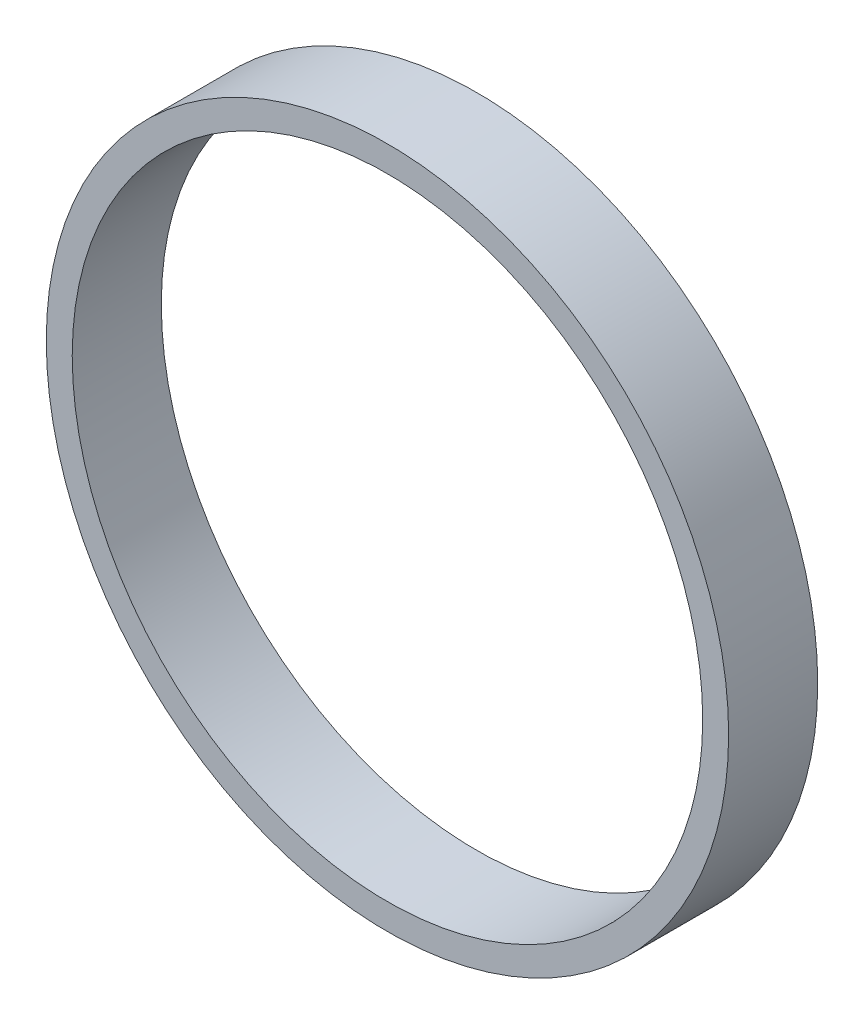
ISO-10303-21;
HEADER;
FILE_DESCRIPTION(('STEP AP214'),'2;1');
FILE_NAME('part.step','',(''),(''),'','','');
FILE_SCHEMA(('AUTOMOTIVE_DESIGN { 1 0 10303 214 1 1 1 1 }'));
ENDSEC;
DATA;
#1=APPLICATION_CONTEXT('core data for automotive mechanical design processes');
#2=APPLICATION_PROTOCOL_DEFINITION('international standard','automotive_design',2000,#1);
#3=PRODUCT_CONTEXT('',#1,'mechanical');
#4=PRODUCT('Part','Part','',(#3));
#5=PRODUCT_RELATED_PRODUCT_CATEGORY('part','',(#4));
#6=PRODUCT_DEFINITION_FORMATION('','',#4);
#7=PRODUCT_DEFINITION_CONTEXT('part definition',#1,'design');
#8=PRODUCT_DEFINITION('design','',#6,#7);
#9=PRODUCT_DEFINITION_SHAPE('','',#8);
#10=(LENGTH_UNIT() NAMED_UNIT(*) SI_UNIT(.MILLI.,.METRE.));
#11=(NAMED_UNIT(*) PLANE_ANGLE_UNIT() SI_UNIT($,.RADIAN.));
#12=(NAMED_UNIT(*) SI_UNIT($,.STERADIAN.) SOLID_ANGLE_UNIT());
#13=UNCERTAINTY_MEASURE_WITH_UNIT(LENGTH_MEASURE(1.E-05),#10,'distance_accuracy_value','');
#14=(GEOMETRIC_REPRESENTATION_CONTEXT(3) GLOBAL_UNCERTAINTY_ASSIGNED_CONTEXT((#13)) GLOBAL_UNIT_ASSIGNED_CONTEXT((#10,
#11,#12)) REPRESENTATION_CONTEXT('',''));
#15=CARTESIAN_POINT('',(0.,0.,0.));
#16=DIRECTION('',(0.,0.,1.));
#17=DIRECTION('',(1.,0.,0.));
#18=AXIS2_PLACEMENT_3D('',#15,#16,#17);
#19=CARTESIAN_POINT('',(0.,0.,10.3));
#20=DIRECTION('',(0.,0.,1.));
#21=DIRECTION('',(1.,0.,0.));
#22=AXIS2_PLACEMENT_3D('',#19,#20,#21);
#23=PLANE('',#22);
#24=CARTESIAN_POINT('',(0.,0.,10.3));
#25=DIRECTION('',(0.,0.,1.));
#26=DIRECTION('',(1.,0.,0.));
#27=AXIS2_PLACEMENT_3D('',#24,#25,#26);
#28=CIRCLE('',#27,78.9);
#29=CARTESIAN_POINT('',(78.9,0.,10.3));
#30=VERTEX_POINT('',#29);
#31=EDGE_CURVE('E10',#30,#30,#28,.T.);
#32=ORIENTED_EDGE('',*,*,#31,.T.);
#33=EDGE_LOOP('',(#32));
#34=FACE_BOUND('',#33,.T.);
#35=CARTESIAN_POINT('',(0.,0.,10.3));
#36=DIRECTION('',(0.,0.,1.));
#37=DIRECTION('',(1.,0.,0.));
#38=AXIS2_PLACEMENT_3D('',#35,#36,#37);
#39=CIRCLE('',#38,72.9);
#40=CARTESIAN_POINT('',(72.9,0.,10.3));
#41=VERTEX_POINT('',#40);
#42=EDGE_CURVE('E42',#41,#41,#39,.T.);
#43=ORIENTED_EDGE('',*,*,#42,.F.);
#44=EDGE_LOOP('',(#43));
#45=FACE_BOUND('',#44,.T.);
#46=ADVANCED_FACE('F31',(#34,#45),#23,.T.);
#47=CARTESIAN_POINT('',(0.,0.,-10.3));
#48=DIRECTION('',(0.,0.,1.));
#49=DIRECTION('',(1.,0.,0.));
#50=AXIS2_PLACEMENT_3D('',#47,#48,#49);
#51=PLANE('',#50);
#52=CARTESIAN_POINT('',(0.,0.,-10.3));
#53=DIRECTION('',(0.,0.,1.));
#54=DIRECTION('',(1.,0.,0.));
#55=AXIS2_PLACEMENT_3D('',#52,#53,#54);
#56=CIRCLE('',#55,78.9);
#57=CARTESIAN_POINT('',(78.9,0.,-10.3));
#58=VERTEX_POINT('',#57);
#59=EDGE_CURVE('E35',#58,#58,#56,.T.);
#60=ORIENTED_EDGE('',*,*,#59,.F.);
#61=EDGE_LOOP('',(#60));
#62=FACE_BOUND('',#61,.T.);
#63=CARTESIAN_POINT('',(0.,0.,-10.3));
#64=DIRECTION('',(0.,0.,1.));
#65=DIRECTION('',(1.,0.,0.));
#66=AXIS2_PLACEMENT_3D('',#63,#64,#65);
#67=CIRCLE('',#66,72.9);
#68=CARTESIAN_POINT('',(72.9,0.,-10.3));
#69=VERTEX_POINT('',#68);
#70=EDGE_CURVE('E44',#69,#69,#67,.T.);
#71=ORIENTED_EDGE('',*,*,#70,.T.);
#72=EDGE_LOOP('',(#71));
#73=FACE_BOUND('',#72,.T.);
#74=ADVANCED_FACE('F54',(#62,#73),#51,.F.);
#75=CARTESIAN_POINT('',(0.,0.,10.3));
#76=DIRECTION('',(0.,0.,-1.));
#77=DIRECTION('',(-1.,0.,0.));
#78=AXIS2_PLACEMENT_3D('',#75,#76,#77);
#79=CYLINDRICAL_SURFACE('',#78,78.9);
#80=ORIENTED_EDGE('',*,*,#31,.F.);
#81=EDGE_LOOP('',(#80));
#82=FACE_BOUND('',#81,.T.);
#83=ORIENTED_EDGE('',*,*,#59,.T.);
#84=EDGE_LOOP('',(#83));
#85=FACE_BOUND('',#84,.T.);
#86=ADVANCED_FACE('F33',(#82,#85),#79,.T.);
#87=CARTESIAN_POINT('',(0.,0.,10.3));
#88=DIRECTION('',(0.,0.,-1.));
#89=DIRECTION('',(-1.,0.,0.));
#90=AXIS2_PLACEMENT_3D('',#87,#88,#89);
#91=CYLINDRICAL_SURFACE('',#90,72.9);
#92=ORIENTED_EDGE('',*,*,#42,.T.);
#93=EDGE_LOOP('',(#92));
#94=FACE_BOUND('',#93,.T.);
#95=ORIENTED_EDGE('',*,*,#70,.F.);
#96=EDGE_LOOP('',(#95));
#97=FACE_BOUND('',#96,.T.);
#98=ADVANCED_FACE('F50',(#94,#97),#91,.F.);
#99=CLOSED_SHELL('',(#46,#74,#86,#98));
#100=MANIFOLD_SOLID_BREP('B2',#99);
#101=ADVANCED_BREP_SHAPE_REPRESENTATION('',(#18,#100),#14);
#102=SHAPE_DEFINITION_REPRESENTATION(#9,#101);
ENDSEC;
END-ISO-10303-21;
